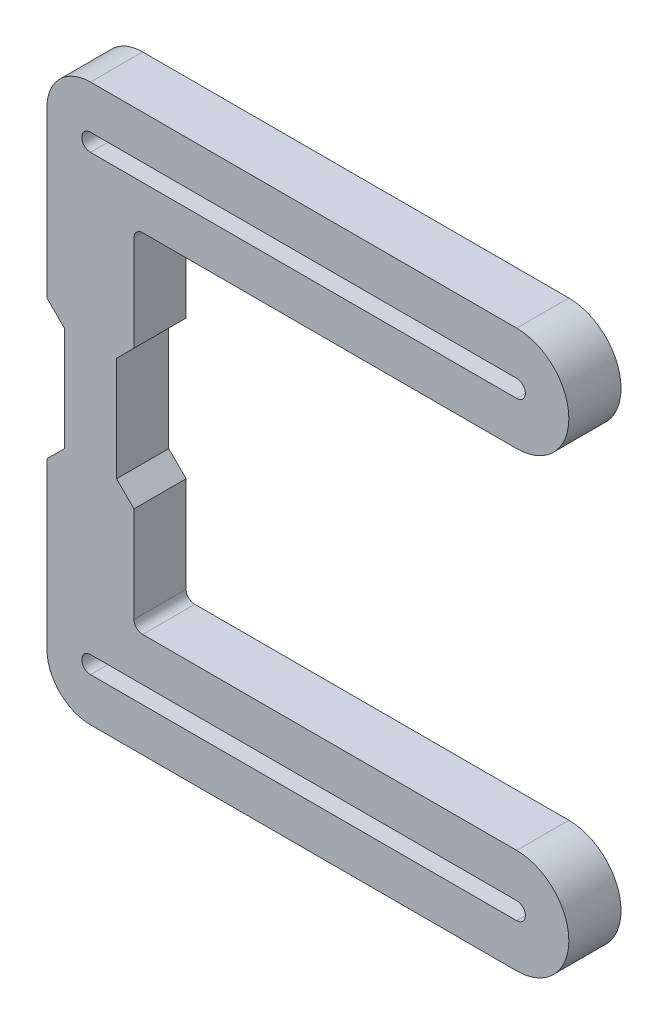
ISO-10303-21;
HEADER;
FILE_DESCRIPTION(('STEP AP214'),'2;1');
FILE_NAME('part.step','',(''),(''),'','','');
FILE_SCHEMA(('AUTOMOTIVE_DESIGN { 1 0 10303 214 1 1 1 1 }'));
ENDSEC;
DATA;
#1=APPLICATION_CONTEXT('core data for automotive mechanical design processes');
#2=APPLICATION_PROTOCOL_DEFINITION('international standard','automotive_design',2000,#1);
#3=PRODUCT_CONTEXT('',#1,'mechanical');
#4=PRODUCT('Part','Part','',(#3));
#5=PRODUCT_RELATED_PRODUCT_CATEGORY('part','',(#4));
#6=PRODUCT_DEFINITION_FORMATION('','',#4);
#7=PRODUCT_DEFINITION_CONTEXT('part definition',#1,'design');
#8=PRODUCT_DEFINITION('design','',#6,#7);
#9=PRODUCT_DEFINITION_SHAPE('','',#8);
#10=(LENGTH_UNIT() NAMED_UNIT(*) SI_UNIT(.MILLI.,.METRE.));
#11=(NAMED_UNIT(*) PLANE_ANGLE_UNIT() SI_UNIT($,.RADIAN.));
#12=(NAMED_UNIT(*) SI_UNIT($,.STERADIAN.) SOLID_ANGLE_UNIT());
#13=UNCERTAINTY_MEASURE_WITH_UNIT(LENGTH_MEASURE(1.E-05),#10,'distance_accuracy_value','');
#14=(GEOMETRIC_REPRESENTATION_CONTEXT(3) GLOBAL_UNCERTAINTY_ASSIGNED_CONTEXT((#13)) GLOBAL_UNIT_ASSIGNED_CONTEXT((#10,
#11,#12)) REPRESENTATION_CONTEXT('',''));
#15=CARTESIAN_POINT('',(0.,0.,0.));
#16=DIRECTION('',(0.,0.,1.));
#17=DIRECTION('',(1.,0.,0.));
#18=AXIS2_PLACEMENT_3D('',#15,#16,#17);
#19=CARTESIAN_POINT('',(6.,19.,6.));
#20=DIRECTION('',(0.,0.,1.));
#21=DIRECTION('',(1.,0.,0.));
#22=AXIS2_PLACEMENT_3D('',#19,#20,#21);
#23=PLANE('',#22);
#24=DIRECTION('',(0.,1.,0.));
#25=VECTOR('',#24,1.);
#26=CARTESIAN_POINT('',(3.,0.,6.));
#27=LINE('',#26,#25);
#28=CARTESIAN_POINT('',(3.00000000000001,-6.00000000000001,6.));
#29=VERTEX_POINT('',#28);
#30=CARTESIAN_POINT('',(3.,6.00000000000001,6.));
#31=VERTEX_POINT('',#30);
#32=EDGE_CURVE('E452',#29,#31,#27,.T.);
#33=ORIENTED_EDGE('',*,*,#32,.T.);
#34=DIRECTION('',(0.707106781186547,0.707106781186548,0.));
#35=VECTOR('',#34,1.);
#36=CARTESIAN_POINT('',(3.,6.00000000000001,6.));
#37=LINE('',#36,#35);
#38=CARTESIAN_POINT('',(5.,8.00000000000001,6.));
#39=VERTEX_POINT('',#38);
#40=EDGE_CURVE('E580',#31,#39,#37,.T.);
#41=ORIENTED_EDGE('',*,*,#40,.T.);
#42=DIRECTION('',(0.,1.,0.));
#43=VECTOR('',#42,1.);
#44=CARTESIAN_POINT('',(5.,8.00000000000001,6.));
#45=LINE('',#44,#43);
#46=CARTESIAN_POINT('',(5.,19.,6.));
#47=VERTEX_POINT('',#46);
#48=EDGE_CURVE('E491',#39,#47,#45,.T.);
#49=ORIENTED_EDGE('',*,*,#48,.T.);
#50=CARTESIAN_POINT('',(6.,19.,6.));
#51=DIRECTION('',(0.,0.,-1.));
#52=DIRECTION('',(1.,0.,0.));
#53=AXIS2_PLACEMENT_3D('',#50,#51,#52);
#54=CIRCLE('',#53,1.);
#55=CARTESIAN_POINT('',(6.,20.,6.));
#56=VERTEX_POINT('',#55);
#57=EDGE_CURVE('E512',#47,#56,#54,.T.);
#58=ORIENTED_EDGE('',*,*,#57,.T.);
#59=DIRECTION('',(1.,0.,0.));
#60=VECTOR('',#59,1.);
#61=CARTESIAN_POINT('',(6.,20.,6.));
#62=LINE('',#61,#60);
#63=CARTESIAN_POINT('',(49.,20.,6.));
#64=VERTEX_POINT('',#63);
#65=EDGE_CURVE('E507',#56,#64,#62,.T.);
#66=ORIENTED_EDGE('',*,*,#65,.T.);
#67=CARTESIAN_POINT('',(49.,26.,6.));
#68=DIRECTION('',(0.,0.,1.));
#69=DIRECTION('',(1.,0.,0.));
#70=AXIS2_PLACEMENT_3D('',#67,#68,#69);
#71=CIRCLE('',#70,6.00000000000001);
#72=CARTESIAN_POINT('',(49.,32.,6.));
#73=VERTEX_POINT('',#72);
#74=EDGE_CURVE('E511',#64,#73,#71,.T.);
#75=ORIENTED_EDGE('',*,*,#74,.T.);
#76=DIRECTION('',(-1.,0.,0.));
#77=VECTOR('',#76,1.);
#78=CARTESIAN_POINT('',(49.,32.,6.));
#79=LINE('',#78,#77);
#80=CARTESIAN_POINT('',(0.,32.,6.));
#81=VERTEX_POINT('',#80);
#82=EDGE_CURVE('E515',#73,#81,#79,.T.);
#83=ORIENTED_EDGE('',*,*,#82,.T.);
#84=CARTESIAN_POINT('',(0.,27.,6.));
#85=DIRECTION('',(0.,0.,1.));
#86=DIRECTION('',(1.,0.,0.));
#87=AXIS2_PLACEMENT_3D('',#84,#85,#86);
#88=CIRCLE('',#87,5.);
#89=CARTESIAN_POINT('',(-5.,27.,6.));
#90=VERTEX_POINT('',#89);
#91=EDGE_CURVE('E523',#81,#90,#88,.T.);
#92=ORIENTED_EDGE('',*,*,#91,.T.);
#93=DIRECTION('',(0.,-1.,0.));
#94=VECTOR('',#93,1.);
#95=CARTESIAN_POINT('',(-5.,27.,6.));
#96=LINE('',#95,#94);
#97=CARTESIAN_POINT('',(-5.,8.00000000000001,6.));
#98=VERTEX_POINT('',#97);
#99=EDGE_CURVE('E525',#90,#98,#96,.T.);
#100=ORIENTED_EDGE('',*,*,#99,.T.);
#101=DIRECTION('',(0.707106781186547,-0.707106781186548,0.));
#102=VECTOR('',#101,1.);
#103=CARTESIAN_POINT('',(-5.,8.00000000000001,6.));
#104=LINE('',#103,#102);
#105=CARTESIAN_POINT('',(-3.,6.00000000000001,6.));
#106=VERTEX_POINT('',#105);
#107=EDGE_CURVE('E415',#98,#106,#104,.T.);
#108=ORIENTED_EDGE('',*,*,#107,.T.);
#109=DIRECTION('',(0.,-1.,0.));
#110=VECTOR('',#109,1.);
#111=CARTESIAN_POINT('',(-3.,6.00000000000001,6.));
#112=LINE('',#111,#110);
#113=CARTESIAN_POINT('',(-2.99999999999999,-6.00000000000001,6.));
#114=VERTEX_POINT('',#113);
#115=EDGE_CURVE('E409',#106,#114,#112,.T.);
#116=ORIENTED_EDGE('',*,*,#115,.T.);
#117=DIRECTION('',(0.707106781186546,0.707106781186549,0.));
#118=VECTOR('',#117,1.);
#119=CARTESIAN_POINT('',(-4.99999999999999,-8.00000000000002,6.));
#120=LINE('',#119,#118);
#121=CARTESIAN_POINT('',(-4.99999999999999,-8.00000000000002,6.));
#122=VERTEX_POINT('',#121);
#123=EDGE_CURVE('E294',#122,#114,#120,.T.);
#124=ORIENTED_EDGE('',*,*,#123,.F.);
#125=DIRECTION('',(0.,1.,0.));
#126=VECTOR('',#125,1.);
#127=CARTESIAN_POINT('',(-4.99999999999997,-27.,6.));
#128=LINE('',#127,#126);
#129=CARTESIAN_POINT('',(-4.99999999999997,-27.,6.));
#130=VERTEX_POINT('',#129);
#131=EDGE_CURVE('E298',#130,#122,#128,.T.);
#132=ORIENTED_EDGE('',*,*,#131,.F.);
#133=CARTESIAN_POINT('',(0.,-27.,6.));
#134=DIRECTION('',(0.,0.,-1.));
#135=DIRECTION('',(1.,0.,0.));
#136=AXIS2_PLACEMENT_3D('',#133,#134,#135);
#137=CIRCLE('',#136,5.);
#138=CARTESIAN_POINT('',(0.,-32.,6.));
#139=VERTEX_POINT('',#138);
#140=EDGE_CURVE('E302',#139,#130,#137,.T.);
#141=ORIENTED_EDGE('',*,*,#140,.F.);
#142=DIRECTION('',(-1.,0.,0.));
#143=VECTOR('',#142,1.);
#144=CARTESIAN_POINT('',(49.,-32.,6.));
#145=LINE('',#144,#143);
#146=CARTESIAN_POINT('',(49.,-32.,6.));
#147=VERTEX_POINT('',#146);
#148=EDGE_CURVE('E307',#147,#139,#145,.T.);
#149=ORIENTED_EDGE('',*,*,#148,.F.);
#150=CARTESIAN_POINT('',(49.,-26.,6.));
#151=DIRECTION('',(0.,0.,-1.));
#152=DIRECTION('',(1.,0.,0.));
#153=AXIS2_PLACEMENT_3D('',#150,#151,#152);
#154=CIRCLE('',#153,6.00000000000001);
#155=CARTESIAN_POINT('',(49.,-20.,6.));
#156=VERTEX_POINT('',#155);
#157=EDGE_CURVE('E311',#156,#147,#154,.T.);
#158=ORIENTED_EDGE('',*,*,#157,.F.);
#159=DIRECTION('',(1.,0.,0.));
#160=VECTOR('',#159,1.);
#161=CARTESIAN_POINT('',(6.00000000000002,-20.,6.));
#162=LINE('',#161,#160);
#163=CARTESIAN_POINT('',(6.00000000000002,-20.,6.));
#164=VERTEX_POINT('',#163);
#165=EDGE_CURVE('E315',#164,#156,#162,.T.);
#166=ORIENTED_EDGE('',*,*,#165,.F.);
#167=CARTESIAN_POINT('',(6.00000000000002,-19.,6.));
#168=DIRECTION('',(0.,0.,1.));
#169=DIRECTION('',(1.,0.,0.));
#170=AXIS2_PLACEMENT_3D('',#167,#168,#169);
#171=CIRCLE('',#170,1.);
#172=CARTESIAN_POINT('',(5.00000000000002,-19.,6.));
#173=VERTEX_POINT('',#172);
#174=EDGE_CURVE('E319',#173,#164,#171,.T.);
#175=ORIENTED_EDGE('',*,*,#174,.F.);
#176=DIRECTION('',(0.,-1.,0.));
#177=VECTOR('',#176,1.);
#178=CARTESIAN_POINT('',(5.00000000000001,-8.00000000000001,6.));
#179=LINE('',#178,#177);
#180=CARTESIAN_POINT('',(5.00000000000001,-8.00000000000001,6.));
#181=VERTEX_POINT('',#180);
#182=EDGE_CURVE('E323',#181,#173,#179,.T.);
#183=ORIENTED_EDGE('',*,*,#182,.F.);
#184=DIRECTION('',(0.707106781186548,-0.707106781186547,0.));
#185=VECTOR('',#184,1.);
#186=CARTESIAN_POINT('',(3.00000000000001,-6.00000000000001,6.));
#187=LINE('',#186,#185);
#188=EDGE_CURVE('E327',#29,#181,#187,.T.);
#189=ORIENTED_EDGE('',*,*,#188,.F.);
#190=EDGE_LOOP('',(#33,#41,#49,#58,#66,#75,#83,#92,#100,#108,#116,#124,#132,#141,#149,#158,#166,
#175,#183,#189));
#191=FACE_BOUND('',#190,.T.);
#192=DIRECTION('',(1.,0.,0.));
#193=VECTOR('',#192,1.);
#194=CARTESIAN_POINT('',(0.,25.,6.));
#195=LINE('',#194,#193);
#196=CARTESIAN_POINT('',(0.,25.,6.));
#197=VERTEX_POINT('',#196);
#198=CARTESIAN_POINT('',(49.,25.,6.));
#199=VERTEX_POINT('',#198);
#200=EDGE_CURVE('E400',#197,#199,#195,.T.);
#201=ORIENTED_EDGE('',*,*,#200,.F.);
#202=CARTESIAN_POINT('',(0.,26.,6.));
#203=DIRECTION('',(0.,0.,1.));
#204=DIRECTION('',(1.,0.,0.));
#205=AXIS2_PLACEMENT_3D('',#202,#203,#204);
#206=CIRCLE('',#205,1.);
#207=CARTESIAN_POINT('',(0.,27.,6.));
#208=VERTEX_POINT('',#207);
#209=EDGE_CURVE('E397',#208,#197,#206,.T.);
#210=ORIENTED_EDGE('',*,*,#209,.F.);
#211=DIRECTION('',(-1.,0.,0.));
#212=VECTOR('',#211,1.);
#213=CARTESIAN_POINT('',(0.,27.,6.));
#214=LINE('',#213,#212);
#215=CARTESIAN_POINT('',(49.,27.,6.));
#216=VERTEX_POINT('',#215);
#217=EDGE_CURVE('E599',#216,#208,#214,.T.);
#218=ORIENTED_EDGE('',*,*,#217,.F.);
#219=CARTESIAN_POINT('',(49.,26.,6.));
#220=DIRECTION('',(0.,0.,1.));
#221=DIRECTION('',(1.,0.,0.));
#222=AXIS2_PLACEMENT_3D('',#219,#220,#221);
#223=CIRCLE('',#222,0.999999999999997);
#224=EDGE_CURVE('E405',#199,#216,#223,.T.);
#225=ORIENTED_EDGE('',*,*,#224,.F.);
#226=EDGE_LOOP('',(#201,#210,#218,#225));
#227=FACE_BOUND('',#226,.T.);
#228=CARTESIAN_POINT('',(0.,-26.,6.));
#229=DIRECTION('',(0.,0.,-1.));
#230=DIRECTION('',(1.,0.,0.));
#231=AXIS2_PLACEMENT_3D('',#228,#229,#230);
#232=CIRCLE('',#231,1.);
#233=CARTESIAN_POINT('',(0.,-27.,6.));
#234=VERTEX_POINT('',#233);
#235=CARTESIAN_POINT('',(0.,-25.,6.));
#236=VERTEX_POINT('',#235);
#237=EDGE_CURVE('E249',#234,#236,#232,.T.);
#238=ORIENTED_EDGE('',*,*,#237,.T.);
#239=DIRECTION('',(1.,0.,0.));
#240=VECTOR('',#239,1.);
#241=CARTESIAN_POINT('',(0.,-25.,6.));
#242=LINE('',#241,#240);
#243=CARTESIAN_POINT('',(49.,-25.,6.));
#244=VERTEX_POINT('',#243);
#245=EDGE_CURVE('E263',#236,#244,#242,.T.);
#246=ORIENTED_EDGE('',*,*,#245,.T.);
#247=CARTESIAN_POINT('',(49.,-26.,6.));
#248=DIRECTION('',(0.,0.,-1.));
#249=DIRECTION('',(1.,0.,0.));
#250=AXIS2_PLACEMENT_3D('',#247,#248,#249);
#251=CIRCLE('',#250,0.999999999999997);
#252=CARTESIAN_POINT('',(49.,-27.,6.));
#253=VERTEX_POINT('',#252);
#254=EDGE_CURVE('E259',#244,#253,#251,.T.);
#255=ORIENTED_EDGE('',*,*,#254,.T.);
#256=DIRECTION('',(-1.,0.,0.));
#257=VECTOR('',#256,1.);
#258=CARTESIAN_POINT('',(0.,-27.,6.));
#259=LINE('',#258,#257);
#260=EDGE_CURVE('E238',#253,#234,#259,.T.);
#261=ORIENTED_EDGE('',*,*,#260,.T.);
#262=EDGE_LOOP('',(#238,#246,#255,#261));
#263=FACE_BOUND('',#262,.T.);
#264=ADVANCED_FACE('F46',(#191,#227,#263),#23,.T.);
#265=CARTESIAN_POINT('',(6.,19.,0.));
#266=DIRECTION('',(0.,0.,1.));
#267=DIRECTION('',(1.,0.,0.));
#268=AXIS2_PLACEMENT_3D('',#265,#266,#267);
#269=PLANE('',#268);
#270=DIRECTION('',(0.,1.,0.));
#271=VECTOR('',#270,1.);
#272=CARTESIAN_POINT('',(3.,0.,0.));
#273=LINE('',#272,#271);
#274=CARTESIAN_POINT('',(3.00000000000001,-6.00000000000001,0.));
#275=VERTEX_POINT('',#274);
#276=CARTESIAN_POINT('',(3.,6.00000000000001,0.));
#277=VERTEX_POINT('',#276);
#278=EDGE_CURVE('E417',#275,#277,#273,.T.);
#279=ORIENTED_EDGE('',*,*,#278,.F.);
#280=DIRECTION('',(0.707106781186548,-0.707106781186547,0.));
#281=VECTOR('',#280,1.);
#282=CARTESIAN_POINT('',(3.00000000000001,-6.00000000000001,0.));
#283=LINE('',#282,#281);
#284=CARTESIAN_POINT('',(5.00000000000001,-8.00000000000001,0.));
#285=VERTEX_POINT('',#284);
#286=EDGE_CURVE('E299',#275,#285,#283,.T.);
#287=ORIENTED_EDGE('',*,*,#286,.T.);
#288=DIRECTION('',(0.,-1.,0.));
#289=VECTOR('',#288,1.);
#290=CARTESIAN_POINT('',(5.00000000000001,-8.00000000000001,0.));
#291=LINE('',#290,#289);
#292=CARTESIAN_POINT('',(5.00000000000002,-19.,0.));
#293=VERTEX_POINT('',#292);
#294=EDGE_CURVE('E359',#285,#293,#291,.T.);
#295=ORIENTED_EDGE('',*,*,#294,.T.);
#296=CARTESIAN_POINT('',(6.00000000000002,-19.,0.));
#297=DIRECTION('',(0.,0.,1.));
#298=DIRECTION('',(1.,0.,0.));
#299=AXIS2_PLACEMENT_3D('',#296,#297,#298);
#300=CIRCLE('',#299,1.);
#301=CARTESIAN_POINT('',(6.00000000000002,-20.,0.));
#302=VERTEX_POINT('',#301);
#303=EDGE_CURVE('E355',#293,#302,#300,.T.);
#304=ORIENTED_EDGE('',*,*,#303,.T.);
#305=DIRECTION('',(1.,0.,0.));
#306=VECTOR('',#305,1.);
#307=CARTESIAN_POINT('',(6.00000000000002,-20.,0.));
#308=LINE('',#307,#306);
#309=CARTESIAN_POINT('',(49.,-20.,0.));
#310=VERTEX_POINT('',#309);
#311=EDGE_CURVE('E351',#302,#310,#308,.T.);
#312=ORIENTED_EDGE('',*,*,#311,.T.);
#313=CARTESIAN_POINT('',(49.,-26.,0.));
#314=DIRECTION('',(0.,0.,-1.));
#315=DIRECTION('',(1.,0.,0.));
#316=AXIS2_PLACEMENT_3D('',#313,#314,#315);
#317=CIRCLE('',#316,6.00000000000001);
#318=CARTESIAN_POINT('',(49.,-32.,0.));
#319=VERTEX_POINT('',#318);
#320=EDGE_CURVE('E347',#310,#319,#317,.T.);
#321=ORIENTED_EDGE('',*,*,#320,.T.);
#322=DIRECTION('',(-1.,0.,0.));
#323=VECTOR('',#322,1.);
#324=CARTESIAN_POINT('',(49.,-32.,0.));
#325=LINE('',#324,#323);
#326=CARTESIAN_POINT('',(0.,-32.,0.));
#327=VERTEX_POINT('',#326);
#328=EDGE_CURVE('E343',#319,#327,#325,.T.);
#329=ORIENTED_EDGE('',*,*,#328,.T.);
#330=CARTESIAN_POINT('',(0.,-27.,0.));
#331=DIRECTION('',(0.,0.,-1.));
#332=DIRECTION('',(1.,0.,0.));
#333=AXIS2_PLACEMENT_3D('',#330,#331,#332);
#334=CIRCLE('',#333,5.);
#335=CARTESIAN_POINT('',(-4.99999999999997,-27.,0.));
#336=VERTEX_POINT('',#335);
#337=EDGE_CURVE('E339',#327,#336,#334,.T.);
#338=ORIENTED_EDGE('',*,*,#337,.T.);
#339=DIRECTION('',(0.,1.,0.));
#340=VECTOR('',#339,1.);
#341=CARTESIAN_POINT('',(-4.99999999999997,-27.,0.));
#342=LINE('',#341,#340);
#343=CARTESIAN_POINT('',(-4.99999999999999,-8.00000000000002,0.));
#344=VERTEX_POINT('',#343);
#345=EDGE_CURVE('E335',#336,#344,#342,.T.);
#346=ORIENTED_EDGE('',*,*,#345,.T.);
#347=DIRECTION('',(0.707106781186546,0.707106781186549,0.));
#348=VECTOR('',#347,1.);
#349=CARTESIAN_POINT('',(-4.99999999999999,-8.00000000000002,0.));
#350=LINE('',#349,#348);
#351=CARTESIAN_POINT('',(-2.99999999999999,-6.00000000000001,0.));
#352=VERTEX_POINT('',#351);
#353=EDGE_CURVE('E245',#344,#352,#350,.T.);
#354=ORIENTED_EDGE('',*,*,#353,.T.);
#355=DIRECTION('',(0.,-1.,0.));
#356=VECTOR('',#355,1.);
#357=CARTESIAN_POINT('',(-3.,6.00000000000001,0.));
#358=LINE('',#357,#356);
#359=CARTESIAN_POINT('',(-3.,6.00000000000001,0.));
#360=VERTEX_POINT('',#359);
#361=EDGE_CURVE('E449',#360,#352,#358,.T.);
#362=ORIENTED_EDGE('',*,*,#361,.F.);
#363=DIRECTION('',(0.707106781186547,-0.707106781186548,0.));
#364=VECTOR('',#363,1.);
#365=CARTESIAN_POINT('',(-5.,8.00000000000001,0.));
#366=LINE('',#365,#364);
#367=CARTESIAN_POINT('',(-5.,8.00000000000001,0.));
#368=VERTEX_POINT('',#367);
#369=EDGE_CURVE('E446',#368,#360,#366,.T.);
#370=ORIENTED_EDGE('',*,*,#369,.F.);
#371=DIRECTION('',(0.,-1.,0.));
#372=VECTOR('',#371,1.);
#373=CARTESIAN_POINT('',(-5.,27.,0.));
#374=LINE('',#373,#372);
#375=CARTESIAN_POINT('',(-5.,27.,0.));
#376=VERTEX_POINT('',#375);
#377=EDGE_CURVE('E443',#376,#368,#374,.T.);
#378=ORIENTED_EDGE('',*,*,#377,.F.);
#379=CARTESIAN_POINT('',(0.,27.,0.));
#380=DIRECTION('',(0.,0.,1.));
#381=DIRECTION('',(1.,0.,0.));
#382=AXIS2_PLACEMENT_3D('',#379,#380,#381);
#383=CIRCLE('',#382,5.);
#384=CARTESIAN_POINT('',(0.,32.,0.));
#385=VERTEX_POINT('',#384);
#386=EDGE_CURVE('E440',#385,#376,#383,.T.);
#387=ORIENTED_EDGE('',*,*,#386,.F.);
#388=DIRECTION('',(-1.,0.,0.));
#389=VECTOR('',#388,1.);
#390=CARTESIAN_POINT('',(49.,32.,0.));
#391=LINE('',#390,#389);
#392=CARTESIAN_POINT('',(49.,32.,0.));
#393=VERTEX_POINT('',#392);
#394=EDGE_CURVE('E437',#393,#385,#391,.T.);
#395=ORIENTED_EDGE('',*,*,#394,.F.);
#396=CARTESIAN_POINT('',(49.,26.,0.));
#397=DIRECTION('',(0.,0.,1.));
#398=DIRECTION('',(1.,0.,0.));
#399=AXIS2_PLACEMENT_3D('',#396,#397,#398);
#400=CIRCLE('',#399,6.00000000000001);
#401=CARTESIAN_POINT('',(49.,20.,0.));
#402=VERTEX_POINT('',#401);
#403=EDGE_CURVE('E434',#402,#393,#400,.T.);
#404=ORIENTED_EDGE('',*,*,#403,.F.);
#405=DIRECTION('',(1.,0.,0.));
#406=VECTOR('',#405,1.);
#407=CARTESIAN_POINT('',(6.,20.,0.));
#408=LINE('',#407,#406);
#409=CARTESIAN_POINT('',(6.,20.,0.));
#410=VERTEX_POINT('',#409);
#411=EDGE_CURVE('E431',#410,#402,#408,.T.);
#412=ORIENTED_EDGE('',*,*,#411,.F.);
#413=CARTESIAN_POINT('',(6.,19.,0.));
#414=DIRECTION('',(0.,0.,-1.));
#415=DIRECTION('',(1.,0.,0.));
#416=AXIS2_PLACEMENT_3D('',#413,#414,#415);
#417=CIRCLE('',#416,1.);
#418=CARTESIAN_POINT('',(5.,19.,0.));
#419=VERTEX_POINT('',#418);
#420=EDGE_CURVE('E428',#419,#410,#417,.T.);
#421=ORIENTED_EDGE('',*,*,#420,.F.);
#422=DIRECTION('',(0.,1.,0.));
#423=VECTOR('',#422,1.);
#424=CARTESIAN_POINT('',(5.,8.00000000000001,0.));
#425=LINE('',#424,#423);
#426=CARTESIAN_POINT('',(5.,8.00000000000001,0.));
#427=VERTEX_POINT('',#426);
#428=EDGE_CURVE('E425',#427,#419,#425,.T.);
#429=ORIENTED_EDGE('',*,*,#428,.F.);
#430=DIRECTION('',(0.707106781186547,0.707106781186548,0.));
#431=VECTOR('',#430,1.);
#432=CARTESIAN_POINT('',(3.,6.00000000000001,0.));
#433=LINE('',#432,#431);
#434=EDGE_CURVE('E421',#277,#427,#433,.T.);
#435=ORIENTED_EDGE('',*,*,#434,.F.);
#436=EDGE_LOOP('',(#279,#287,#295,#304,#312,#321,#329,#338,#346,#354,#362,#370,#378,#387,#395,
#404,#412,#421,#429,#435));
#437=FACE_BOUND('',#436,.T.);
#438=CARTESIAN_POINT('',(0.,26.,0.));
#439=DIRECTION('',(0.,0.,1.));
#440=DIRECTION('',(1.,0.,0.));
#441=AXIS2_PLACEMENT_3D('',#438,#439,#440);
#442=CIRCLE('',#441,1.);
#443=CARTESIAN_POINT('',(0.,27.,0.));
#444=VERTEX_POINT('',#443);
#445=CARTESIAN_POINT('',(0.,25.,0.));
#446=VERTEX_POINT('',#445);
#447=EDGE_CURVE('E70',#444,#446,#442,.T.);
#448=ORIENTED_EDGE('',*,*,#447,.T.);
#449=DIRECTION('',(1.,0.,0.));
#450=VECTOR('',#449,1.);
#451=CARTESIAN_POINT('',(0.,25.,0.));
#452=LINE('',#451,#450);
#453=CARTESIAN_POINT('',(49.,25.,0.));
#454=VERTEX_POINT('',#453);
#455=EDGE_CURVE('E607',#446,#454,#452,.T.);
#456=ORIENTED_EDGE('',*,*,#455,.T.);
#457=CARTESIAN_POINT('',(49.,26.,0.));
#458=DIRECTION('',(0.,0.,1.));
#459=DIRECTION('',(1.,0.,0.));
#460=AXIS2_PLACEMENT_3D('',#457,#458,#459);
#461=CIRCLE('',#460,0.999999999999997);
#462=CARTESIAN_POINT('',(49.,27.,0.));
#463=VERTEX_POINT('',#462);
#464=EDGE_CURVE('E603',#454,#463,#461,.T.);
#465=ORIENTED_EDGE('',*,*,#464,.T.);
#466=DIRECTION('',(-1.,0.,0.));
#467=VECTOR('',#466,1.);
#468=CARTESIAN_POINT('',(0.,27.,0.));
#469=LINE('',#468,#467);
#470=EDGE_CURVE('E401',#463,#444,#469,.T.);
#471=ORIENTED_EDGE('',*,*,#470,.T.);
#472=EDGE_LOOP('',(#448,#456,#465,#471));
#473=FACE_BOUND('',#472,.T.);
#474=DIRECTION('',(1.,0.,0.));
#475=VECTOR('',#474,1.);
#476=CARTESIAN_POINT('',(0.,-25.,0.));
#477=LINE('',#476,#475);
#478=CARTESIAN_POINT('',(0.,-25.,0.));
#479=VERTEX_POINT('',#478);
#480=CARTESIAN_POINT('',(49.,-25.,0.));
#481=VERTEX_POINT('',#480);
#482=EDGE_CURVE('E257',#479,#481,#477,.T.);
#483=ORIENTED_EDGE('',*,*,#482,.F.);
#484=CARTESIAN_POINT('',(0.,-26.,0.));
#485=DIRECTION('',(0.,0.,-1.));
#486=DIRECTION('',(1.,0.,0.));
#487=AXIS2_PLACEMENT_3D('',#484,#485,#486);
#488=CIRCLE('',#487,1.);
#489=CARTESIAN_POINT('',(0.,-27.,0.));
#490=VERTEX_POINT('',#489);
#491=EDGE_CURVE('E275',#490,#479,#488,.T.);
#492=ORIENTED_EDGE('',*,*,#491,.F.);
#493=DIRECTION('',(-1.,0.,0.));
#494=VECTOR('',#493,1.);
#495=CARTESIAN_POINT('',(0.,-27.,0.));
#496=LINE('',#495,#494);
#497=CARTESIAN_POINT('',(49.,-27.,0.));
#498=VERTEX_POINT('',#497);
#499=EDGE_CURVE('E241',#498,#490,#496,.T.);
#500=ORIENTED_EDGE('',*,*,#499,.F.);
#501=CARTESIAN_POINT('',(49.,-26.,0.));
#502=DIRECTION('',(0.,0.,-1.));
#503=DIRECTION('',(1.,0.,0.));
#504=AXIS2_PLACEMENT_3D('',#501,#502,#503);
#505=CIRCLE('',#504,0.999999999999997);
#506=EDGE_CURVE('E280',#481,#498,#505,.T.);
#507=ORIENTED_EDGE('',*,*,#506,.F.);
#508=EDGE_LOOP('',(#483,#492,#500,#507));
#509=FACE_BOUND('',#508,.T.);
#510=ADVANCED_FACE('F495',(#437,#473,#509),#269,.F.);
#511=CARTESIAN_POINT('',(3.,0.,6.));
#512=DIRECTION('',(-1.,0.,0.));
#513=DIRECTION('',(0.,-1.,0.));
#514=AXIS2_PLACEMENT_3D('',#511,#512,#513);
#515=PLANE('',#514);
#516=ORIENTED_EDGE('',*,*,#278,.T.);
#517=DIRECTION('',(0.,0.,-1.));
#518=VECTOR('',#517,1.);
#519=CARTESIAN_POINT('',(3.,6.00000000000001,6.));
#520=LINE('',#519,#518);
#521=EDGE_CURVE('E12',#31,#277,#520,.T.);
#522=ORIENTED_EDGE('',*,*,#521,.F.);
#523=ORIENTED_EDGE('',*,*,#32,.F.);
#524=DIRECTION('',(0.,0.,-1.));
#525=VECTOR('',#524,1.);
#526=CARTESIAN_POINT('',(3.00000000000001,-6.00000000000001,6.));
#527=LINE('',#526,#525);
#528=EDGE_CURVE('E331',#29,#275,#527,.T.);
#529=ORIENTED_EDGE('',*,*,#528,.T.);
#530=EDGE_LOOP('',(#516,#522,#523,#529));
#531=FACE_BOUND('',#530,.T.);
#532=ADVANCED_FACE('F48',(#531),#515,.F.);
#533=CARTESIAN_POINT('',(3.,6.00000000000001,6.));
#534=DIRECTION('',(-0.707106781186548,0.707106781186547,0.));
#535=DIRECTION('',(-0.707106781186547,-0.707106781186548,0.));
#536=AXIS2_PLACEMENT_3D('',#533,#534,#535);
#537=PLANE('',#536);
#538=ORIENTED_EDGE('',*,*,#434,.T.);
#539=DIRECTION('',(0.,0.,-1.));
#540=VECTOR('',#539,1.);
#541=CARTESIAN_POINT('',(5.,8.00000000000001,6.));
#542=LINE('',#541,#540);
#543=EDGE_CURVE('E55',#39,#427,#542,.T.);
#544=ORIENTED_EDGE('',*,*,#543,.F.);
#545=ORIENTED_EDGE('',*,*,#40,.F.);
#546=ORIENTED_EDGE('',*,*,#521,.T.);
#547=EDGE_LOOP('',(#538,#544,#545,#546));
#548=FACE_BOUND('',#547,.T.);
#549=ADVANCED_FACE('F584',(#548),#537,.F.);
#550=CARTESIAN_POINT('',(5.,8.00000000000001,6.));
#551=DIRECTION('',(-1.,0.,0.));
#552=DIRECTION('',(0.,0.,1.));
#553=AXIS2_PLACEMENT_3D('',#550,#551,#552);
#554=PLANE('',#553);
#555=ORIENTED_EDGE('',*,*,#428,.T.);
#556=DIRECTION('',(0.,0.,-1.));
#557=VECTOR('',#556,1.);
#558=CARTESIAN_POINT('',(5.,19.,6.));
#559=LINE('',#558,#557);
#560=EDGE_CURVE('E480',#47,#419,#559,.T.);
#561=ORIENTED_EDGE('',*,*,#560,.F.);
#562=ORIENTED_EDGE('',*,*,#48,.F.);
#563=ORIENTED_EDGE('',*,*,#543,.T.);
#564=EDGE_LOOP('',(#555,#561,#562,#563));
#565=FACE_BOUND('',#564,.T.);
#566=ADVANCED_FACE('F489',(#565),#554,.F.);
#567=CARTESIAN_POINT('',(6.,19.,6.));
#568=DIRECTION('',(0.,0.,-1.));
#569=DIRECTION('',(-1.,0.,0.));
#570=AXIS2_PLACEMENT_3D('',#567,#568,#569);
#571=CYLINDRICAL_SURFACE('',#570,1.);
#572=ORIENTED_EDGE('',*,*,#420,.T.);
#573=DIRECTION('',(0.,0.,-1.));
#574=VECTOR('',#573,1.);
#575=CARTESIAN_POINT('',(6.,20.,6.));
#576=LINE('',#575,#574);
#577=EDGE_CURVE('E476',#56,#410,#576,.T.);
#578=ORIENTED_EDGE('',*,*,#577,.F.);
#579=ORIENTED_EDGE('',*,*,#57,.F.);
#580=ORIENTED_EDGE('',*,*,#560,.T.);
#581=EDGE_LOOP('',(#572,#578,#579,#580));
#582=FACE_BOUND('',#581,.T.);
#583=ADVANCED_FACE('F501',(#582),#571,.F.);
#584=CARTESIAN_POINT('',(6.,20.,6.));
#585=DIRECTION('',(0.,1.,0.));
#586=DIRECTION('',(0.,0.,1.));
#587=AXIS2_PLACEMENT_3D('',#584,#585,#586);
#588=PLANE('',#587);
#589=ORIENTED_EDGE('',*,*,#411,.T.);
#590=DIRECTION('',(0.,0.,-1.));
#591=VECTOR('',#590,1.);
#592=CARTESIAN_POINT('',(49.,20.,6.));
#593=LINE('',#592,#591);
#594=EDGE_CURVE('E472',#64,#402,#593,.T.);
#595=ORIENTED_EDGE('',*,*,#594,.F.);
#596=ORIENTED_EDGE('',*,*,#65,.F.);
#597=ORIENTED_EDGE('',*,*,#577,.T.);
#598=EDGE_LOOP('',(#589,#595,#596,#597));
#599=FACE_BOUND('',#598,.T.);
#600=ADVANCED_FACE('F505',(#599),#588,.F.);
#601=CARTESIAN_POINT('',(49.,26.,6.));
#602=DIRECTION('',(0.,0.,-1.));
#603=DIRECTION('',(-1.,0.,0.));
#604=AXIS2_PLACEMENT_3D('',#601,#602,#603);
#605=CYLINDRICAL_SURFACE('',#604,6.00000000000001);
#606=ORIENTED_EDGE('',*,*,#403,.T.);
#607=DIRECTION('',(0.,0.,-1.));
#608=VECTOR('',#607,1.);
#609=CARTESIAN_POINT('',(49.,32.,6.));
#610=LINE('',#609,#608);
#611=EDGE_CURVE('E468',#73,#393,#610,.T.);
#612=ORIENTED_EDGE('',*,*,#611,.F.);
#613=ORIENTED_EDGE('',*,*,#74,.F.);
#614=ORIENTED_EDGE('',*,*,#594,.T.);
#615=EDGE_LOOP('',(#606,#612,#613,#614));
#616=FACE_BOUND('',#615,.T.);
#617=ADVANCED_FACE('F661',(#616),#605,.T.);
#618=CARTESIAN_POINT('',(49.,32.,6.));
#619=DIRECTION('',(0.,-1.,0.));
#620=DIRECTION('',(1.,0.,0.));
#621=AXIS2_PLACEMENT_3D('',#618,#619,#620);
#622=PLANE('',#621);
#623=ORIENTED_EDGE('',*,*,#394,.T.);
#624=DIRECTION('',(0.,0.,-1.));
#625=VECTOR('',#624,1.);
#626=CARTESIAN_POINT('',(0.,32.,6.));
#627=LINE('',#626,#625);
#628=EDGE_CURVE('E464',#81,#385,#627,.T.);
#629=ORIENTED_EDGE('',*,*,#628,.F.);
#630=ORIENTED_EDGE('',*,*,#82,.F.);
#631=ORIENTED_EDGE('',*,*,#611,.T.);
#632=EDGE_LOOP('',(#623,#629,#630,#631));
#633=FACE_BOUND('',#632,.T.);
#634=ADVANCED_FACE('F657',(#633),#622,.F.);
#635=CARTESIAN_POINT('',(0.,27.,6.));
#636=DIRECTION('',(0.,0.,-1.));
#637=DIRECTION('',(-1.,0.,0.));
#638=AXIS2_PLACEMENT_3D('',#635,#636,#637);
#639=CYLINDRICAL_SURFACE('',#638,5.);
#640=ORIENTED_EDGE('',*,*,#386,.T.);
#641=DIRECTION('',(0.,0.,-1.));
#642=VECTOR('',#641,1.);
#643=CARTESIAN_POINT('',(-5.,27.,6.));
#644=LINE('',#643,#642);
#645=EDGE_CURVE('E460',#90,#376,#644,.T.);
#646=ORIENTED_EDGE('',*,*,#645,.F.);
#647=ORIENTED_EDGE('',*,*,#91,.F.);
#648=ORIENTED_EDGE('',*,*,#628,.T.);
#649=EDGE_LOOP('',(#640,#646,#647,#648));
#650=FACE_BOUND('',#649,.T.);
#651=ADVANCED_FACE('F653',(#650),#639,.T.);
#652=CARTESIAN_POINT('',(-5.,27.,6.));
#653=DIRECTION('',(1.,0.,0.));
#654=DIRECTION('',(0.,0.,-1.));
#655=AXIS2_PLACEMENT_3D('',#652,#653,#654);
#656=PLANE('',#655);
#657=ORIENTED_EDGE('',*,*,#377,.T.);
#658=DIRECTION('',(0.,0.,-1.));
#659=VECTOR('',#658,1.);
#660=CARTESIAN_POINT('',(-5.,8.00000000000001,6.));
#661=LINE('',#660,#659);
#662=EDGE_CURVE('E456',#98,#368,#661,.T.);
#663=ORIENTED_EDGE('',*,*,#662,.F.);
#664=ORIENTED_EDGE('',*,*,#99,.F.);
#665=ORIENTED_EDGE('',*,*,#645,.T.);
#666=EDGE_LOOP('',(#657,#663,#664,#665));
#667=FACE_BOUND('',#666,.T.);
#668=ADVANCED_FACE('F650',(#667),#656,.F.);
#669=CARTESIAN_POINT('',(-5.,8.00000000000001,6.));
#670=DIRECTION('',(0.707106781186548,0.707106781186547,0.));
#671=DIRECTION('',(-0.707106781186547,0.707106781186548,0.));
#672=AXIS2_PLACEMENT_3D('',#669,#670,#671);
#673=PLANE('',#672);
#674=ORIENTED_EDGE('',*,*,#369,.T.);
#675=DIRECTION('',(0.,0.,-1.));
#676=VECTOR('',#675,1.);
#677=CARTESIAN_POINT('',(-3.,6.00000000000001,6.));
#678=LINE('',#677,#676);
#679=EDGE_CURVE('E414',#106,#360,#678,.T.);
#680=ORIENTED_EDGE('',*,*,#679,.F.);
#681=ORIENTED_EDGE('',*,*,#107,.F.);
#682=ORIENTED_EDGE('',*,*,#662,.T.);
#683=EDGE_LOOP('',(#674,#680,#681,#682));
#684=FACE_BOUND('',#683,.T.);
#685=ADVANCED_FACE('F538',(#684),#673,.F.);
#686=CARTESIAN_POINT('',(-3.,6.00000000000001,6.));
#687=DIRECTION('',(1.,0.,0.));
#688=DIRECTION('',(0.,0.,-1.));
#689=AXIS2_PLACEMENT_3D('',#686,#687,#688);
#690=PLANE('',#689);
#691=ORIENTED_EDGE('',*,*,#361,.T.);
#692=DIRECTION('',(0.,0.,-1.));
#693=VECTOR('',#692,1.);
#694=CARTESIAN_POINT('',(-2.99999999999999,-6.00000000000001,6.));
#695=LINE('',#694,#693);
#696=EDGE_CURVE('E393',#114,#352,#695,.T.);
#697=ORIENTED_EDGE('',*,*,#696,.F.);
#698=ORIENTED_EDGE('',*,*,#115,.F.);
#699=ORIENTED_EDGE('',*,*,#679,.T.);
#700=EDGE_LOOP('',(#691,#697,#698,#699));
#701=FACE_BOUND('',#700,.T.);
#702=ADVANCED_FACE('F542',(#701),#690,.F.);
#703=CARTESIAN_POINT('',(0.,26.,6.));
#704=DIRECTION('',(0.,0.,-1.));
#705=DIRECTION('',(-1.,0.,0.));
#706=AXIS2_PLACEMENT_3D('',#703,#704,#705);
#707=CYLINDRICAL_SURFACE('',#706,1.);
#708=ORIENTED_EDGE('',*,*,#447,.F.);
#709=DIRECTION('',(0.,0.,-1.));
#710=VECTOR('',#709,1.);
#711=CARTESIAN_POINT('',(0.,27.,6.));
#712=LINE('',#711,#710);
#713=EDGE_CURVE('E596',#208,#444,#712,.T.);
#714=ORIENTED_EDGE('',*,*,#713,.F.);
#715=ORIENTED_EDGE('',*,*,#209,.T.);
#716=DIRECTION('',(0.,0.,-1.));
#717=VECTOR('',#716,1.);
#718=CARTESIAN_POINT('',(0.,25.,6.));
#719=LINE('',#718,#717);
#720=EDGE_CURVE('E422',#197,#446,#719,.T.);
#721=ORIENTED_EDGE('',*,*,#720,.T.);
#722=EDGE_LOOP('',(#708,#714,#715,#721));
#723=FACE_BOUND('',#722,.T.);
#724=ADVANCED_FACE('F624',(#723),#707,.F.);
#725=CARTESIAN_POINT('',(0.,25.,6.));
#726=DIRECTION('',(0.,1.,0.));
#727=DIRECTION('',(-1.,0.,0.));
#728=AXIS2_PLACEMENT_3D('',#725,#726,#727);
#729=PLANE('',#728);
#730=ORIENTED_EDGE('',*,*,#455,.F.);
#731=ORIENTED_EDGE('',*,*,#720,.F.);
#732=ORIENTED_EDGE('',*,*,#200,.T.);
#733=DIRECTION('',(0.,0.,-1.));
#734=VECTOR('',#733,1.);
#735=CARTESIAN_POINT('',(49.,25.,6.));
#736=LINE('',#735,#734);
#737=EDGE_CURVE('E591',#199,#454,#736,.T.);
#738=ORIENTED_EDGE('',*,*,#737,.T.);
#739=EDGE_LOOP('',(#730,#731,#732,#738));
#740=FACE_BOUND('',#739,.T.);
#741=ADVANCED_FACE('F626',(#740),#729,.T.);
#742=CARTESIAN_POINT('',(49.,26.,6.));
#743=DIRECTION('',(0.,0.,-1.));
#744=DIRECTION('',(-1.,0.,0.));
#745=AXIS2_PLACEMENT_3D('',#742,#743,#744);
#746=CYLINDRICAL_SURFACE('',#745,0.999999999999997);
#747=ORIENTED_EDGE('',*,*,#464,.F.);
#748=ORIENTED_EDGE('',*,*,#737,.F.);
#749=ORIENTED_EDGE('',*,*,#224,.T.);
#750=DIRECTION('',(0.,0.,-1.));
#751=VECTOR('',#750,1.);
#752=CARTESIAN_POINT('',(49.,27.,6.));
#753=LINE('',#752,#751);
#754=EDGE_CURVE('E62',#216,#463,#753,.T.);
#755=ORIENTED_EDGE('',*,*,#754,.T.);
#756=EDGE_LOOP('',(#747,#748,#749,#755));
#757=FACE_BOUND('',#756,.T.);
#758=ADVANCED_FACE('F620',(#757),#746,.F.);
#759=CARTESIAN_POINT('',(0.,27.,6.));
#760=DIRECTION('',(0.,-1.,0.));
#761=DIRECTION('',(1.,0.,0.));
#762=AXIS2_PLACEMENT_3D('',#759,#760,#761);
#763=PLANE('',#762);
#764=ORIENTED_EDGE('',*,*,#470,.F.);
#765=ORIENTED_EDGE('',*,*,#754,.F.);
#766=ORIENTED_EDGE('',*,*,#217,.T.);
#767=ORIENTED_EDGE('',*,*,#713,.T.);
#768=EDGE_LOOP('',(#764,#765,#766,#767));
#769=FACE_BOUND('',#768,.T.);
#770=ADVANCED_FACE('F628',(#769),#763,.T.);
#771=CARTESIAN_POINT('',(-4.99999999999999,-8.00000000000002,6.));
#772=DIRECTION('',(-0.707106781186549,0.707106781186546,0.));
#773=DIRECTION('',(-0.707106781186546,-0.707106781186549,0.));
#774=AXIS2_PLACEMENT_3D('',#771,#772,#773);
#775=PLANE('',#774);
#776=ORIENTED_EDGE('',*,*,#353,.F.);
#777=DIRECTION('',(0.,0.,-1.));
#778=VECTOR('',#777,1.);
#779=CARTESIAN_POINT('',(-4.99999999999999,-8.00000000000002,6.));
#780=LINE('',#779,#778);
#781=EDGE_CURVE('E390',#122,#344,#780,.T.);
#782=ORIENTED_EDGE('',*,*,#781,.F.);
#783=ORIENTED_EDGE('',*,*,#123,.T.);
#784=ORIENTED_EDGE('',*,*,#696,.T.);
#785=EDGE_LOOP('',(#776,#782,#783,#784));
#786=FACE_BOUND('',#785,.T.);
#787=ADVANCED_FACE('F545',(#786),#775,.T.);
#788=CARTESIAN_POINT('',(-4.99999999999997,-27.,6.));
#789=DIRECTION('',(-1.,0.,0.));
#790=DIRECTION('',(0.,-1.,0.));
#791=AXIS2_PLACEMENT_3D('',#788,#789,#790);
#792=PLANE('',#791);
#793=ORIENTED_EDGE('',*,*,#345,.F.);
#794=DIRECTION('',(0.,0.,-1.));
#795=VECTOR('',#794,1.);
#796=CARTESIAN_POINT('',(-4.99999999999997,-27.,6.));
#797=LINE('',#796,#795);
#798=EDGE_CURVE('E387',#130,#336,#797,.T.);
#799=ORIENTED_EDGE('',*,*,#798,.F.);
#800=ORIENTED_EDGE('',*,*,#131,.T.);
#801=ORIENTED_EDGE('',*,*,#781,.T.);
#802=EDGE_LOOP('',(#793,#799,#800,#801));
#803=FACE_BOUND('',#802,.T.);
#804=ADVANCED_FACE('F550',(#803),#792,.T.);
#805=CARTESIAN_POINT('',(0.,-27.,6.));
#806=DIRECTION('',(0.,0.,-1.));
#807=DIRECTION('',(-1.,0.,0.));
#808=AXIS2_PLACEMENT_3D('',#805,#806,#807);
#809=CYLINDRICAL_SURFACE('',#808,5.);
#810=ORIENTED_EDGE('',*,*,#337,.F.);
#811=DIRECTION('',(0.,0.,-1.));
#812=VECTOR('',#811,1.);
#813=CARTESIAN_POINT('',(0.,-32.,6.));
#814=LINE('',#813,#812);
#815=EDGE_CURVE('E384',#139,#327,#814,.T.);
#816=ORIENTED_EDGE('',*,*,#815,.F.);
#817=ORIENTED_EDGE('',*,*,#140,.T.);
#818=ORIENTED_EDGE('',*,*,#798,.T.);
#819=EDGE_LOOP('',(#810,#816,#817,#818));
#820=FACE_BOUND('',#819,.T.);
#821=ADVANCED_FACE('F553',(#820),#809,.T.);
#822=CARTESIAN_POINT('',(49.,-32.,6.));
#823=DIRECTION('',(0.,-1.,0.));
#824=DIRECTION('',(1.,0.,0.));
#825=AXIS2_PLACEMENT_3D('',#822,#823,#824);
#826=PLANE('',#825);
#827=ORIENTED_EDGE('',*,*,#328,.F.);
#828=DIRECTION('',(0.,0.,-1.));
#829=VECTOR('',#828,1.);
#830=CARTESIAN_POINT('',(49.,-32.,6.));
#831=LINE('',#830,#829);
#832=EDGE_CURVE('E381',#147,#319,#831,.T.);
#833=ORIENTED_EDGE('',*,*,#832,.F.);
#834=ORIENTED_EDGE('',*,*,#148,.T.);
#835=ORIENTED_EDGE('',*,*,#815,.T.);
#836=EDGE_LOOP('',(#827,#833,#834,#835));
#837=FACE_BOUND('',#836,.T.);
#838=ADVANCED_FACE('F558',(#837),#826,.T.);
#839=CARTESIAN_POINT('',(49.,-26.,6.));
#840=DIRECTION('',(0.,0.,-1.));
#841=DIRECTION('',(-1.,0.,0.));
#842=AXIS2_PLACEMENT_3D('',#839,#840,#841);
#843=CYLINDRICAL_SURFACE('',#842,6.00000000000001);
#844=ORIENTED_EDGE('',*,*,#320,.F.);
#845=DIRECTION('',(0.,0.,-1.));
#846=VECTOR('',#845,1.);
#847=CARTESIAN_POINT('',(49.,-20.,6.));
#848=LINE('',#847,#846);
#849=EDGE_CURVE('E378',#156,#310,#848,.T.);
#850=ORIENTED_EDGE('',*,*,#849,.F.);
#851=ORIENTED_EDGE('',*,*,#157,.T.);
#852=ORIENTED_EDGE('',*,*,#832,.T.);
#853=EDGE_LOOP('',(#844,#850,#851,#852));
#854=FACE_BOUND('',#853,.T.);
#855=ADVANCED_FACE('F561',(#854),#843,.T.);
#856=CARTESIAN_POINT('',(6.00000000000002,-20.,6.));
#857=DIRECTION('',(0.,1.,0.));
#858=DIRECTION('',(-1.,0.,0.));
#859=AXIS2_PLACEMENT_3D('',#856,#857,#858);
#860=PLANE('',#859);
#861=ORIENTED_EDGE('',*,*,#311,.F.);
#862=DIRECTION('',(0.,0.,-1.));
#863=VECTOR('',#862,1.);
#864=CARTESIAN_POINT('',(6.00000000000002,-20.,6.));
#865=LINE('',#864,#863);
#866=EDGE_CURVE('E375',#164,#302,#865,.T.);
#867=ORIENTED_EDGE('',*,*,#866,.F.);
#868=ORIENTED_EDGE('',*,*,#165,.T.);
#869=ORIENTED_EDGE('',*,*,#849,.T.);
#870=EDGE_LOOP('',(#861,#867,#868,#869));
#871=FACE_BOUND('',#870,.T.);
#872=ADVANCED_FACE('F566',(#871),#860,.T.);
#873=CARTESIAN_POINT('',(6.00000000000002,-19.,6.));
#874=DIRECTION('',(0.,0.,-1.));
#875=DIRECTION('',(-1.,0.,0.));
#876=AXIS2_PLACEMENT_3D('',#873,#874,#875);
#877=CYLINDRICAL_SURFACE('',#876,1.);
#878=ORIENTED_EDGE('',*,*,#303,.F.);
#879=DIRECTION('',(0.,0.,-1.));
#880=VECTOR('',#879,1.);
#881=CARTESIAN_POINT('',(5.00000000000002,-19.,6.));
#882=LINE('',#881,#880);
#883=EDGE_CURVE('E372',#173,#293,#882,.T.);
#884=ORIENTED_EDGE('',*,*,#883,.F.);
#885=ORIENTED_EDGE('',*,*,#174,.T.);
#886=ORIENTED_EDGE('',*,*,#866,.T.);
#887=EDGE_LOOP('',(#878,#884,#885,#886));
#888=FACE_BOUND('',#887,.T.);
#889=ADVANCED_FACE('F569',(#888),#877,.F.);
#890=CARTESIAN_POINT('',(5.00000000000001,-8.00000000000001,6.));
#891=DIRECTION('',(1.,0.,0.));
#892=DIRECTION('',(0.,1.,0.));
#893=AXIS2_PLACEMENT_3D('',#890,#891,#892);
#894=PLANE('',#893);
#895=ORIENTED_EDGE('',*,*,#294,.F.);
#896=DIRECTION('',(0.,0.,-1.));
#897=VECTOR('',#896,1.);
#898=CARTESIAN_POINT('',(5.00000000000001,-8.00000000000001,6.));
#899=LINE('',#898,#897);
#900=EDGE_CURVE('E369',#181,#285,#899,.T.);
#901=ORIENTED_EDGE('',*,*,#900,.F.);
#902=ORIENTED_EDGE('',*,*,#182,.T.);
#903=ORIENTED_EDGE('',*,*,#883,.T.);
#904=EDGE_LOOP('',(#895,#901,#902,#903));
#905=FACE_BOUND('',#904,.T.);
#906=ADVANCED_FACE('F574',(#905),#894,.T.);
#907=CARTESIAN_POINT('',(3.00000000000001,-6.00000000000001,6.));
#908=DIRECTION('',(0.707106781186547,0.707106781186548,0.));
#909=DIRECTION('',(-0.707106781186548,0.707106781186547,0.));
#910=AXIS2_PLACEMENT_3D('',#907,#908,#909);
#911=PLANE('',#910);
#912=ORIENTED_EDGE('',*,*,#286,.F.);
#913=ORIENTED_EDGE('',*,*,#528,.F.);
#914=ORIENTED_EDGE('',*,*,#188,.T.);
#915=ORIENTED_EDGE('',*,*,#900,.T.);
#916=EDGE_LOOP('',(#912,#913,#914,#915));
#917=FACE_BOUND('',#916,.T.);
#918=ADVANCED_FACE('F577',(#917),#911,.T.);
#919=CARTESIAN_POINT('',(0.,-26.,6.));
#920=DIRECTION('',(0.,0.,-1.));
#921=DIRECTION('',(-1.,0.,0.));
#922=AXIS2_PLACEMENT_3D('',#919,#920,#921);
#923=CYLINDRICAL_SURFACE('',#922,1.);
#924=ORIENTED_EDGE('',*,*,#491,.T.);
#925=DIRECTION('',(0.,0.,-1.));
#926=VECTOR('',#925,1.);
#927=CARTESIAN_POINT('',(0.,-25.,6.));
#928=LINE('',#927,#926);
#929=EDGE_CURVE('E252',#236,#479,#928,.T.);
#930=ORIENTED_EDGE('',*,*,#929,.F.);
#931=ORIENTED_EDGE('',*,*,#237,.F.);
#932=DIRECTION('',(0.,0.,-1.));
#933=VECTOR('',#932,1.);
#934=CARTESIAN_POINT('',(0.,-27.,6.));
#935=LINE('',#934,#933);
#936=EDGE_CURVE('E234',#234,#490,#935,.T.);
#937=ORIENTED_EDGE('',*,*,#936,.T.);
#938=EDGE_LOOP('',(#924,#930,#931,#937));
#939=FACE_BOUND('',#938,.T.);
#940=ADVANCED_FACE('F250',(#939),#923,.F.);
#941=CARTESIAN_POINT('',(0.,-27.,6.));
#942=DIRECTION('',(0.,-1.,0.));
#943=DIRECTION('',(1.,0.,0.));
#944=AXIS2_PLACEMENT_3D('',#941,#942,#943);
#945=PLANE('',#944);
#946=ORIENTED_EDGE('',*,*,#499,.T.);
#947=ORIENTED_EDGE('',*,*,#936,.F.);
#948=ORIENTED_EDGE('',*,*,#260,.F.);
#949=DIRECTION('',(0.,0.,-1.));
#950=VECTOR('',#949,1.);
#951=CARTESIAN_POINT('',(49.,-27.,6.));
#952=LINE('',#951,#950);
#953=EDGE_CURVE('E246',#253,#498,#952,.T.);
#954=ORIENTED_EDGE('',*,*,#953,.T.);
#955=EDGE_LOOP('',(#946,#947,#948,#954));
#956=FACE_BOUND('',#955,.T.);
#957=ADVANCED_FACE('F236',(#956),#945,.F.);
#958=CARTESIAN_POINT('',(49.,-26.,6.));
#959=DIRECTION('',(0.,0.,-1.));
#960=DIRECTION('',(-1.,0.,0.));
#961=AXIS2_PLACEMENT_3D('',#958,#959,#960);
#962=CYLINDRICAL_SURFACE('',#961,0.999999999999997);
#963=ORIENTED_EDGE('',*,*,#506,.T.);
#964=ORIENTED_EDGE('',*,*,#953,.F.);
#965=ORIENTED_EDGE('',*,*,#254,.F.);
#966=DIRECTION('',(0.,0.,-1.));
#967=VECTOR('',#966,1.);
#968=CARTESIAN_POINT('',(49.,-25.,6.));
#969=LINE('',#968,#967);
#970=EDGE_CURVE('E289',#244,#481,#969,.T.);
#971=ORIENTED_EDGE('',*,*,#970,.T.);
#972=EDGE_LOOP('',(#963,#964,#965,#971));
#973=FACE_BOUND('',#972,.T.);
#974=ADVANCED_FACE('F861',(#973),#962,.F.);
#975=CARTESIAN_POINT('',(0.,-25.,6.));
#976=DIRECTION('',(0.,1.,0.));
#977=DIRECTION('',(-1.,0.,0.));
#978=AXIS2_PLACEMENT_3D('',#975,#976,#977);
#979=PLANE('',#978);
#980=ORIENTED_EDGE('',*,*,#482,.T.);
#981=ORIENTED_EDGE('',*,*,#970,.F.);
#982=ORIENTED_EDGE('',*,*,#245,.F.);
#983=ORIENTED_EDGE('',*,*,#929,.T.);
#984=EDGE_LOOP('',(#980,#981,#982,#983));
#985=FACE_BOUND('',#984,.T.);
#986=ADVANCED_FACE('F869',(#985),#979,.F.);
#987=CLOSED_SHELL('',(#264,#510,#532,#549,#566,#583,#600,#617,#634,#651,#668,#685,#702,#724,
#741,#758,#770,#787,#804,#821,#838,#855,#872,#889,#906,#918,#940,#957,#974,#986));
#988=MANIFOLD_SOLID_BREP('B2',#987);
#989=ADVANCED_BREP_SHAPE_REPRESENTATION('',(#18,#988),#14);
#990=SHAPE_DEFINITION_REPRESENTATION(#9,#989);
ENDSEC;
END-ISO-10303-21;
